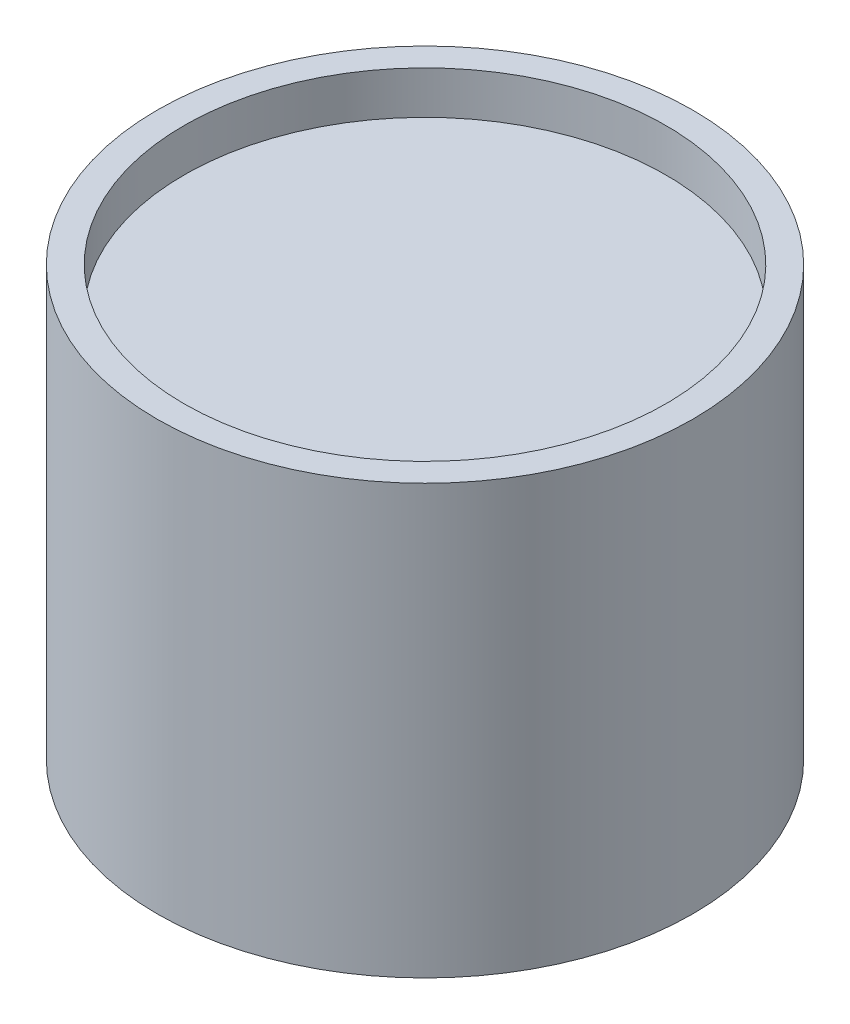
ISO-10303-21;
HEADER;
FILE_DESCRIPTION(('STEP AP214'),'2;1');
FILE_NAME('part.step','',(''),(''),'','','');
FILE_SCHEMA(('AUTOMOTIVE_DESIGN { 1 0 10303 214 1 1 1 1 }'));
ENDSEC;
DATA;
#1=APPLICATION_CONTEXT('core data for automotive mechanical design processes');
#2=APPLICATION_PROTOCOL_DEFINITION('international standard','automotive_design',2000,#1);
#3=PRODUCT_CONTEXT('',#1,'mechanical');
#4=PRODUCT('Part','Part','',(#3));
#5=PRODUCT_RELATED_PRODUCT_CATEGORY('part','',(#4));
#6=PRODUCT_DEFINITION_FORMATION('','',#4);
#7=PRODUCT_DEFINITION_CONTEXT('part definition',#1,'design');
#8=PRODUCT_DEFINITION('design','',#6,#7);
#9=PRODUCT_DEFINITION_SHAPE('','',#8);
#10=(LENGTH_UNIT() NAMED_UNIT(*) SI_UNIT(.MILLI.,.METRE.));
#11=(NAMED_UNIT(*) PLANE_ANGLE_UNIT() SI_UNIT($,.RADIAN.));
#12=(NAMED_UNIT(*) SI_UNIT($,.STERADIAN.) SOLID_ANGLE_UNIT());
#13=UNCERTAINTY_MEASURE_WITH_UNIT(LENGTH_MEASURE(1.E-05),#10,'distance_accuracy_value','');
#14=(GEOMETRIC_REPRESENTATION_CONTEXT(3) GLOBAL_UNCERTAINTY_ASSIGNED_CONTEXT((#13)) GLOBAL_UNIT_ASSIGNED_CONTEXT((#10,
#11,#12)) REPRESENTATION_CONTEXT('',''));
#15=CARTESIAN_POINT('',(0.,0.,0.));
#16=DIRECTION('',(0.,0.,1.));
#17=DIRECTION('',(1.,0.,0.));
#18=AXIS2_PLACEMENT_3D('',#15,#16,#17);
#19=CARTESIAN_POINT('',(0.,8.,0.));
#20=DIRECTION('',(0.,-1.,0.));
#21=DIRECTION('',(0.,0.,-1.));
#22=AXIS2_PLACEMENT_3D('',#19,#20,#21);
#23=CYLINDRICAL_SURFACE('',#22,5.);
#24=CARTESIAN_POINT('',(0.,8.,0.));
#25=DIRECTION('',(0.,1.,0.));
#26=DIRECTION('',(0.,0.,1.));
#27=AXIS2_PLACEMENT_3D('',#24,#25,#26);
#28=CIRCLE('',#27,5.);
#29=CARTESIAN_POINT('',(0.,8.,5.));
#30=VERTEX_POINT('',#29);
#31=EDGE_CURVE('E10',#30,#30,#28,.T.);
#32=ORIENTED_EDGE('',*,*,#31,.F.);
#33=EDGE_LOOP('',(#32));
#34=FACE_BOUND('',#33,.T.);
#35=CARTESIAN_POINT('',(0.,0.,0.));
#36=DIRECTION('',(0.,1.,0.));
#37=DIRECTION('',(0.,0.,1.));
#38=AXIS2_PLACEMENT_3D('',#35,#36,#37);
#39=CIRCLE('',#38,5.);
#40=CARTESIAN_POINT('',(0.,0.,5.));
#41=VERTEX_POINT('',#40);
#42=EDGE_CURVE('E37',#41,#41,#39,.T.);
#43=ORIENTED_EDGE('',*,*,#42,.T.);
#44=EDGE_LOOP('',(#43));
#45=FACE_BOUND('',#44,.T.);
#46=ADVANCED_FACE('F34',(#34,#45),#23,.T.);
#47=CARTESIAN_POINT('',(0.,8.,0.));
#48=DIRECTION('',(0.,1.,0.));
#49=DIRECTION('',(0.,0.,1.));
#50=AXIS2_PLACEMENT_3D('',#47,#48,#49);
#51=PLANE('',#50);
#52=CARTESIAN_POINT('',(0.,8.,0.));
#53=DIRECTION('',(0.,1.,0.));
#54=DIRECTION('',(0.,0.,1.));
#55=AXIS2_PLACEMENT_3D('',#52,#53,#54);
#56=CIRCLE('',#55,4.5);
#57=CARTESIAN_POINT('',(0.,8.,4.5));
#58=VERTEX_POINT('',#57);
#59=EDGE_CURVE('E46',#58,#58,#56,.T.);
#60=ORIENTED_EDGE('',*,*,#59,.F.);
#61=EDGE_LOOP('',(#60));
#62=FACE_BOUND('',#61,.T.);
#63=ORIENTED_EDGE('',*,*,#31,.T.);
#64=EDGE_LOOP('',(#63));
#65=FACE_BOUND('',#64,.T.);
#66=ADVANCED_FACE('F71',(#62,#65),#51,.T.);
#67=CARTESIAN_POINT('',(0.,0.,0.));
#68=DIRECTION('',(0.,1.,0.));
#69=DIRECTION('',(0.,0.,1.));
#70=AXIS2_PLACEMENT_3D('',#67,#68,#69);
#71=PLANE('',#70);
#72=CARTESIAN_POINT('',(0.,0.,0.));
#73=DIRECTION('',(0.,-1.,0.));
#74=DIRECTION('',(0.,0.,-1.));
#75=AXIS2_PLACEMENT_3D('',#72,#73,#74);
#76=CIRCLE('',#75,4.5);
#77=CARTESIAN_POINT('',(0.,0.,-4.5));
#78=VERTEX_POINT('',#77);
#79=EDGE_CURVE('E52',#78,#78,#76,.T.);
#80=ORIENTED_EDGE('',*,*,#79,.F.);
#81=EDGE_LOOP('',(#80));
#82=FACE_BOUND('',#81,.T.);
#83=ORIENTED_EDGE('',*,*,#42,.F.);
#84=EDGE_LOOP('',(#83));
#85=FACE_BOUND('',#84,.T.);
#86=ADVANCED_FACE('F67',(#82,#85),#71,.F.);
#87=CARTESIAN_POINT('',(0.,7.2,0.));
#88=DIRECTION('',(0.,1.,0.));
#89=DIRECTION('',(0.,0.,1.));
#90=AXIS2_PLACEMENT_3D('',#87,#88,#89);
#91=CYLINDRICAL_SURFACE('',#90,4.5);
#92=CARTESIAN_POINT('',(0.,7.2,0.));
#93=DIRECTION('',(0.,1.,0.));
#94=DIRECTION('',(0.,0.,1.));
#95=AXIS2_PLACEMENT_3D('',#92,#93,#94);
#96=CIRCLE('',#95,4.5);
#97=CARTESIAN_POINT('',(0.,7.2,4.5));
#98=VERTEX_POINT('',#97);
#99=EDGE_CURVE('E44',#98,#98,#96,.T.);
#100=ORIENTED_EDGE('',*,*,#99,.F.);
#101=EDGE_LOOP('',(#100));
#102=FACE_BOUND('',#101,.T.);
#103=ORIENTED_EDGE('',*,*,#59,.T.);
#104=EDGE_LOOP('',(#103));
#105=FACE_BOUND('',#104,.T.);
#106=ADVANCED_FACE('F70',(#102,#105),#91,.F.);
#107=CARTESIAN_POINT('',(0.,7.2,0.));
#108=DIRECTION('',(0.,1.,0.));
#109=DIRECTION('',(0.,0.,1.));
#110=AXIS2_PLACEMENT_3D('',#107,#108,#109);
#111=PLANE('',#110);
#112=ORIENTED_EDGE('',*,*,#99,.T.);
#113=EDGE_LOOP('',(#112));
#114=FACE_BOUND('',#113,.T.);
#115=ADVANCED_FACE('F63',(#114),#111,.T.);
#116=CARTESIAN_POINT('',(0.,0.8,0.));
#117=DIRECTION('',(0.,-1.,0.));
#118=DIRECTION('',(0.,0.,-1.));
#119=AXIS2_PLACEMENT_3D('',#116,#117,#118);
#120=CYLINDRICAL_SURFACE('',#119,4.5);
#121=CARTESIAN_POINT('',(0.,0.8,0.));
#122=DIRECTION('',(0.,-1.,0.));
#123=DIRECTION('',(0.,0.,-1.));
#124=AXIS2_PLACEMENT_3D('',#121,#122,#123);
#125=CIRCLE('',#124,4.5);
#126=CARTESIAN_POINT('',(0.,0.8,-4.5));
#127=VERTEX_POINT('',#126);
#128=EDGE_CURVE('E49',#127,#127,#125,.T.);
#129=ORIENTED_EDGE('',*,*,#128,.F.);
#130=EDGE_LOOP('',(#129));
#131=FACE_BOUND('',#130,.T.);
#132=ORIENTED_EDGE('',*,*,#79,.T.);
#133=EDGE_LOOP('',(#132));
#134=FACE_BOUND('',#133,.T.);
#135=ADVANCED_FACE('F60',(#131,#134),#120,.F.);
#136=CARTESIAN_POINT('',(0.,0.8,0.));
#137=DIRECTION('',(0.,-1.,0.));
#138=DIRECTION('',(0.,0.,-1.));
#139=AXIS2_PLACEMENT_3D('',#136,#137,#138);
#140=PLANE('',#139);
#141=ORIENTED_EDGE('',*,*,#128,.T.);
#142=EDGE_LOOP('',(#141));
#143=FACE_BOUND('',#142,.T.);
#144=ADVANCED_FACE('F58',(#143),#140,.T.);
#145=CLOSED_SHELL('',(#46,#66,#86,#106,#115,#135,#144));
#146=MANIFOLD_SOLID_BREP('B2',#145);
#147=ADVANCED_BREP_SHAPE_REPRESENTATION('',(#18,#146),#14);
#148=SHAPE_DEFINITION_REPRESENTATION(#9,#147);
ENDSEC;
END-ISO-10303-21;
